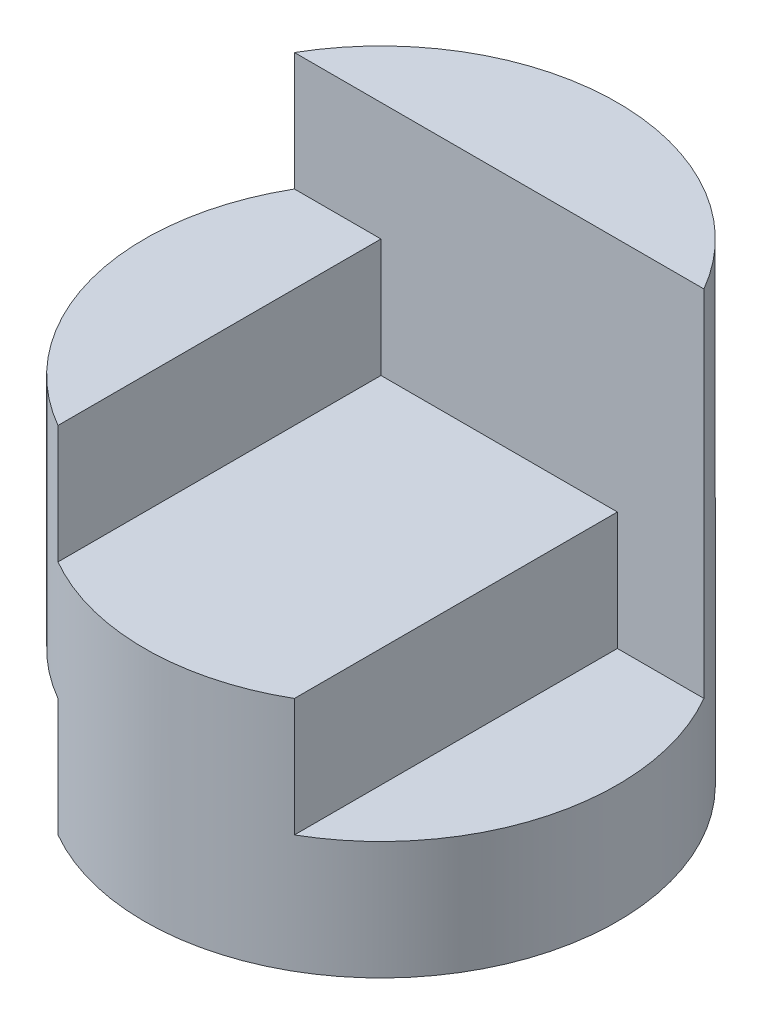
ISO-10303-21;
HEADER;
FILE_DESCRIPTION(('STEP AP214'),'2;1');
FILE_NAME('part.step','',(''),(''),'','','');
FILE_SCHEMA(('AUTOMOTIVE_DESIGN { 1 0 10303 214 1 1 1 1 }'));
ENDSEC;
DATA;
#1=APPLICATION_CONTEXT('core data for automotive mechanical design processes');
#2=APPLICATION_PROTOCOL_DEFINITION('international standard','automotive_design',2000,#1);
#3=PRODUCT_CONTEXT('',#1,'mechanical');
#4=PRODUCT('Part','Part','',(#3));
#5=PRODUCT_RELATED_PRODUCT_CATEGORY('part','',(#4));
#6=PRODUCT_DEFINITION_FORMATION('','',#4);
#7=PRODUCT_DEFINITION_CONTEXT('part definition',#1,'design');
#8=PRODUCT_DEFINITION('design','',#6,#7);
#9=PRODUCT_DEFINITION_SHAPE('','',#8);
#10=(LENGTH_UNIT() NAMED_UNIT(*) SI_UNIT(.MILLI.,.METRE.));
#11=(NAMED_UNIT(*) PLANE_ANGLE_UNIT() SI_UNIT($,.RADIAN.));
#12=(NAMED_UNIT(*) SI_UNIT($,.STERADIAN.) SOLID_ANGLE_UNIT());
#13=UNCERTAINTY_MEASURE_WITH_UNIT(LENGTH_MEASURE(1.E-05),#10,'distance_accuracy_value','');
#14=(GEOMETRIC_REPRESENTATION_CONTEXT(3) GLOBAL_UNCERTAINTY_ASSIGNED_CONTEXT((#13)) GLOBAL_UNIT_ASSIGNED_CONTEXT((#10,
#11,#12)) REPRESENTATION_CONTEXT('',''));
#15=CARTESIAN_POINT('',(0.,0.,0.));
#16=DIRECTION('',(0.,0.,1.));
#17=DIRECTION('',(1.,0.,0.));
#18=AXIS2_PLACEMENT_3D('',#15,#16,#17);
#19=CARTESIAN_POINT('',(0.,4.,0.));
#20=DIRECTION('',(0.,-1.,0.));
#21=DIRECTION('',(0.,0.,-1.));
#22=AXIS2_PLACEMENT_3D('',#19,#20,#21);
#23=CYLINDRICAL_SURFACE('',#22,2.);
#24=DIRECTION('',(0.,-1.,0.));
#25=VECTOR('',#24,1.);
#26=CARTESIAN_POINT('',(1.73205080756888,4.,-1.));
#27=LINE('',#26,#25);
#28=CARTESIAN_POINT('',(1.73205080756888,4.,-1.));
#29=VERTEX_POINT('',#28);
#30=CARTESIAN_POINT('',(1.73205080756888,1.,-1.));
#31=VERTEX_POINT('',#30);
#32=EDGE_CURVE('E47',#29,#31,#27,.T.);
#33=ORIENTED_EDGE('',*,*,#32,.T.);
#34=CARTESIAN_POINT('',(0.,1.,0.));
#35=DIRECTION('',(0.,1.,0.));
#36=DIRECTION('',(0.,0.,1.));
#37=AXIS2_PLACEMENT_3D('',#34,#35,#36);
#38=CIRCLE('',#37,2.);
#39=CARTESIAN_POINT('',(1.,1.,1.73205080756888));
#40=VERTEX_POINT('',#39);
#41=EDGE_CURVE('E40',#40,#31,#38,.T.);
#42=ORIENTED_EDGE('',*,*,#41,.F.);
#43=DIRECTION('',(0.,-1.,0.));
#44=VECTOR('',#43,1.);
#45=CARTESIAN_POINT('',(1.,4.,1.73205080756888));
#46=LINE('',#45,#44);
#47=CARTESIAN_POINT('',(1.,2.,1.73205080756888));
#48=VERTEX_POINT('',#47);
#49=EDGE_CURVE('E135',#48,#40,#46,.T.);
#50=ORIENTED_EDGE('',*,*,#49,.F.);
#51=CARTESIAN_POINT('',(0.,2.,0.));
#52=DIRECTION('',(0.,1.,0.));
#53=DIRECTION('',(-1.,0.,0.));
#54=AXIS2_PLACEMENT_3D('',#51,#52,#53);
#55=CIRCLE('',#54,2.);
#56=CARTESIAN_POINT('',(-1.,2.,1.73205080756888));
#57=VERTEX_POINT('',#56);
#58=EDGE_CURVE('E133',#57,#48,#55,.T.);
#59=ORIENTED_EDGE('',*,*,#58,.F.);
#60=DIRECTION('',(0.,-1.,0.));
#61=VECTOR('',#60,1.);
#62=CARTESIAN_POINT('',(-1.,4.,1.73205080756888));
#63=LINE('',#62,#61);
#64=CARTESIAN_POINT('',(-1.,3.,1.73205080756888));
#65=VERTEX_POINT('',#64);
#66=EDGE_CURVE('E131',#65,#57,#63,.T.);
#67=ORIENTED_EDGE('',*,*,#66,.F.);
#68=CARTESIAN_POINT('',(0.,3.,0.));
#69=DIRECTION('',(0.,1.,0.));
#70=DIRECTION('',(-1.,0.,0.));
#71=AXIS2_PLACEMENT_3D('',#68,#69,#70);
#72=CIRCLE('',#71,2.);
#73=CARTESIAN_POINT('',(-1.73205080756888,3.,-1.));
#74=VERTEX_POINT('',#73);
#75=EDGE_CURVE('E126',#74,#65,#72,.T.);
#76=ORIENTED_EDGE('',*,*,#75,.F.);
#77=DIRECTION('',(0.,-1.,0.));
#78=VECTOR('',#77,1.);
#79=CARTESIAN_POINT('',(-1.73205080756888,4.,-1.));
#80=LINE('',#79,#78);
#81=CARTESIAN_POINT('',(-1.73205080756888,4.,-1.));
#82=VERTEX_POINT('',#81);
#83=EDGE_CURVE('E155',#74,#82,#80,.F.);
#84=ORIENTED_EDGE('',*,*,#83,.T.);
#85=CARTESIAN_POINT('',(0.,4.,0.));
#86=DIRECTION('',(0.,1.,0.));
#87=DIRECTION('',(0.,0.,1.));
#88=AXIS2_PLACEMENT_3D('',#85,#86,#87);
#89=CIRCLE('',#88,2.);
#90=EDGE_CURVE('E112',#29,#82,#89,.T.);
#91=ORIENTED_EDGE('',*,*,#90,.F.);
#92=EDGE_LOOP('',(#33,#42,#50,#59,#67,#76,#84,#91));
#93=FACE_BOUND('',#92,.T.);
#94=DIRECTION('',(0.,-1.,0.));
#95=VECTOR('',#94,1.);
#96=CARTESIAN_POINT('',(-1.,4.,1.73205080756888));
#97=LINE('',#96,#95);
#98=CARTESIAN_POINT('',(-1.,0.,1.73205080756888));
#99=VERTEX_POINT('',#98);
#100=CARTESIAN_POINT('',(-1.,1.,1.73205080756888));
#101=VERTEX_POINT('',#100);
#102=EDGE_CURVE('E157',#99,#101,#97,.F.);
#103=ORIENTED_EDGE('',*,*,#102,.F.);
#104=CARTESIAN_POINT('',(0.,0.,0.));
#105=DIRECTION('',(0.,1.,0.));
#106=DIRECTION('',(0.,0.,1.));
#107=AXIS2_PLACEMENT_3D('',#104,#105,#106);
#108=CIRCLE('',#107,2.);
#109=CARTESIAN_POINT('',(-1.73205080756888,0.,-1.));
#110=VERTEX_POINT('',#109);
#111=EDGE_CURVE('E123',#99,#110,#108,.T.);
#112=ORIENTED_EDGE('',*,*,#111,.T.);
#113=DIRECTION('',(0.,-1.,0.));
#114=VECTOR('',#113,1.);
#115=CARTESIAN_POINT('',(-1.73205080756888,4.,-1.));
#116=LINE('',#115,#114);
#117=CARTESIAN_POINT('',(-1.73205080756888,1.,-1.));
#118=VERTEX_POINT('',#117);
#119=EDGE_CURVE('E55',#110,#118,#116,.F.);
#120=ORIENTED_EDGE('',*,*,#119,.T.);
#121=CARTESIAN_POINT('',(0.,1.,0.));
#122=DIRECTION('',(0.,-1.,0.));
#123=DIRECTION('',(0.,0.,-1.));
#124=AXIS2_PLACEMENT_3D('',#121,#122,#123);
#125=CIRCLE('',#124,2.);
#126=EDGE_CURVE('E11',#101,#118,#125,.T.);
#127=ORIENTED_EDGE('',*,*,#126,.F.);
#128=EDGE_LOOP('',(#103,#112,#120,#127));
#129=FACE_BOUND('',#128,.T.);
#130=ADVANCED_FACE('F33',(#93,#129),#23,.T.);
#131=CARTESIAN_POINT('',(0.,0.,0.));
#132=DIRECTION('',(0.,1.,0.));
#133=DIRECTION('',(0.,0.,1.));
#134=AXIS2_PLACEMENT_3D('',#131,#132,#133);
#135=PLANE('',#134);
#136=DIRECTION('',(0.,0.,1.));
#137=VECTOR('',#136,1.);
#138=CARTESIAN_POINT('',(-1.,0.,0.));
#139=LINE('',#138,#137);
#140=CARTESIAN_POINT('',(-1.,0.,-1.));
#141=VERTEX_POINT('',#140);
#142=EDGE_CURVE('E111',#141,#99,#139,.T.);
#143=ORIENTED_EDGE('',*,*,#142,.F.);
#144=DIRECTION('',(-1.,0.,0.));
#145=VECTOR('',#144,1.);
#146=CARTESIAN_POINT('',(0.,0.,-1.));
#147=LINE('',#146,#145);
#148=EDGE_CURVE('E102',#141,#110,#147,.T.);
#149=ORIENTED_EDGE('',*,*,#148,.T.);
#150=ORIENTED_EDGE('',*,*,#111,.F.);
#151=EDGE_LOOP('',(#143,#149,#150));
#152=FACE_BOUND('',#151,.T.);
#153=ADVANCED_FACE('F122',(#152),#135,.F.);
#154=CARTESIAN_POINT('',(0.,4.,0.));
#155=DIRECTION('',(0.,1.,0.));
#156=DIRECTION('',(0.,0.,1.));
#157=AXIS2_PLACEMENT_3D('',#154,#155,#156);
#158=PLANE('',#157);
#159=DIRECTION('',(-1.,0.,0.));
#160=VECTOR('',#159,1.);
#161=CARTESIAN_POINT('',(0.,4.,-1.));
#162=LINE('',#161,#160);
#163=EDGE_CURVE('E124',#29,#82,#162,.T.);
#164=ORIENTED_EDGE('',*,*,#163,.F.);
#165=ORIENTED_EDGE('',*,*,#90,.T.);
#166=EDGE_LOOP('',(#164,#165));
#167=FACE_BOUND('',#166,.T.);
#168=ADVANCED_FACE('F162',(#167),#158,.T.);
#169=CARTESIAN_POINT('',(-2.,1.,3.));
#170=DIRECTION('',(0.,-1.,0.));
#171=DIRECTION('',(0.,0.,-1.));
#172=AXIS2_PLACEMENT_3D('',#169,#170,#171);
#173=PLANE('',#172);
#174=DIRECTION('',(0.,0.,-1.));
#175=VECTOR('',#174,1.);
#176=CARTESIAN_POINT('',(-1.,1.,3.));
#177=LINE('',#176,#175);
#178=CARTESIAN_POINT('',(-1.,1.,-1.));
#179=VERTEX_POINT('',#178);
#180=EDGE_CURVE('E119',#101,#179,#177,.T.);
#181=ORIENTED_EDGE('',*,*,#180,.F.);
#182=ORIENTED_EDGE('',*,*,#126,.T.);
#183=DIRECTION('',(-1.,0.,0.));
#184=VECTOR('',#183,1.);
#185=CARTESIAN_POINT('',(-2.,1.,-1.));
#186=LINE('',#185,#184);
#187=EDGE_CURVE('E120',#179,#118,#186,.T.);
#188=ORIENTED_EDGE('',*,*,#187,.F.);
#189=EDGE_LOOP('',(#181,#182,#188));
#190=FACE_BOUND('',#189,.T.);
#191=ADVANCED_FACE('F186',(#190),#173,.T.);
#192=CARTESIAN_POINT('',(-1.,0.,3.));
#193=DIRECTION('',(-1.,0.,0.));
#194=DIRECTION('',(0.,0.,1.));
#195=AXIS2_PLACEMENT_3D('',#192,#193,#194);
#196=PLANE('',#195);
#197=ORIENTED_EDGE('',*,*,#102,.T.);
#198=ORIENTED_EDGE('',*,*,#180,.T.);
#199=DIRECTION('',(0.,1.,0.));
#200=VECTOR('',#199,1.);
#201=CARTESIAN_POINT('',(-1.,0.,-1.));
#202=LINE('',#201,#200);
#203=EDGE_CURVE('E105',#141,#179,#202,.T.);
#204=ORIENTED_EDGE('',*,*,#203,.F.);
#205=ORIENTED_EDGE('',*,*,#142,.T.);
#206=EDGE_LOOP('',(#197,#198,#204,#205));
#207=FACE_BOUND('',#206,.T.);
#208=ADVANCED_FACE('F116',(#207),#196,.T.);
#209=CARTESIAN_POINT('',(0.,0.,-1.));
#210=DIRECTION('',(0.,0.,-1.));
#211=DIRECTION('',(-1.,0.,0.));
#212=AXIS2_PLACEMENT_3D('',#209,#210,#211);
#213=PLANE('',#212);
#214=ORIENTED_EDGE('',*,*,#148,.F.);
#215=ORIENTED_EDGE('',*,*,#203,.T.);
#216=ORIENTED_EDGE('',*,*,#187,.T.);
#217=ORIENTED_EDGE('',*,*,#119,.F.);
#218=EDGE_LOOP('',(#214,#215,#216,#217));
#219=FACE_BOUND('',#218,.T.);
#220=ADVANCED_FACE('F104',(#219),#213,.F.);
#221=CARTESIAN_POINT('',(-1.,3.,3.));
#222=DIRECTION('',(0.,1.,0.));
#223=DIRECTION('',(-1.,0.,0.));
#224=AXIS2_PLACEMENT_3D('',#221,#222,#223);
#225=PLANE('',#224);
#226=ORIENTED_EDGE('',*,*,#75,.T.);
#227=DIRECTION('',(0.,0.,-1.));
#228=VECTOR('',#227,1.);
#229=CARTESIAN_POINT('',(-1.,3.,3.));
#230=LINE('',#229,#228);
#231=CARTESIAN_POINT('',(-1.,3.,-1.));
#232=VERTEX_POINT('',#231);
#233=EDGE_CURVE('E171',#65,#232,#230,.T.);
#234=ORIENTED_EDGE('',*,*,#233,.T.);
#235=DIRECTION('',(1.,0.,0.));
#236=VECTOR('',#235,1.);
#237=CARTESIAN_POINT('',(-1.,3.,-1.));
#238=LINE('',#237,#236);
#239=EDGE_CURVE('E172',#74,#232,#238,.T.);
#240=ORIENTED_EDGE('',*,*,#239,.F.);
#241=EDGE_LOOP('',(#226,#234,#240));
#242=FACE_BOUND('',#241,.T.);
#243=ADVANCED_FACE('F170',(#242),#225,.T.);
#244=CARTESIAN_POINT('',(-1.,2.,3.));
#245=DIRECTION('',(1.,0.,0.));
#246=DIRECTION('',(0.,0.,-1.));
#247=AXIS2_PLACEMENT_3D('',#244,#245,#246);
#248=PLANE('',#247);
#249=ORIENTED_EDGE('',*,*,#66,.T.);
#250=DIRECTION('',(0.,0.,-1.));
#251=VECTOR('',#250,1.);
#252=CARTESIAN_POINT('',(-1.,2.,3.));
#253=LINE('',#252,#251);
#254=CARTESIAN_POINT('',(-1.,2.,-1.));
#255=VERTEX_POINT('',#254);
#256=EDGE_CURVE('E179',#57,#255,#253,.T.);
#257=ORIENTED_EDGE('',*,*,#256,.T.);
#258=DIRECTION('',(0.,-1.,0.));
#259=VECTOR('',#258,1.);
#260=CARTESIAN_POINT('',(-1.,2.,-1.));
#261=LINE('',#260,#259);
#262=EDGE_CURVE('E178',#232,#255,#261,.T.);
#263=ORIENTED_EDGE('',*,*,#262,.F.);
#264=ORIENTED_EDGE('',*,*,#233,.F.);
#265=EDGE_LOOP('',(#249,#257,#263,#264));
#266=FACE_BOUND('',#265,.T.);
#267=ADVANCED_FACE('F175',(#266),#248,.T.);
#268=CARTESIAN_POINT('',(1.,2.,3.));
#269=DIRECTION('',(0.,1.,0.));
#270=DIRECTION('',(-1.,0.,0.));
#271=AXIS2_PLACEMENT_3D('',#268,#269,#270);
#272=PLANE('',#271);
#273=ORIENTED_EDGE('',*,*,#58,.T.);
#274=DIRECTION('',(0.,0.,-1.));
#275=VECTOR('',#274,1.);
#276=CARTESIAN_POINT('',(1.,2.,3.));
#277=LINE('',#276,#275);
#278=CARTESIAN_POINT('',(1.,2.,-1.));
#279=VERTEX_POINT('',#278);
#280=EDGE_CURVE('E182',#48,#279,#277,.T.);
#281=ORIENTED_EDGE('',*,*,#280,.T.);
#282=DIRECTION('',(1.,0.,0.));
#283=VECTOR('',#282,1.);
#284=CARTESIAN_POINT('',(1.,2.,-1.));
#285=LINE('',#284,#283);
#286=EDGE_CURVE('E192',#255,#279,#285,.T.);
#287=ORIENTED_EDGE('',*,*,#286,.F.);
#288=ORIENTED_EDGE('',*,*,#256,.F.);
#289=EDGE_LOOP('',(#273,#281,#287,#288));
#290=FACE_BOUND('',#289,.T.);
#291=ADVANCED_FACE('F198',(#290),#272,.T.);
#292=CARTESIAN_POINT('',(1.,1.,3.));
#293=DIRECTION('',(1.,0.,0.));
#294=DIRECTION('',(0.,1.,0.));
#295=AXIS2_PLACEMENT_3D('',#292,#293,#294);
#296=PLANE('',#295);
#297=ORIENTED_EDGE('',*,*,#49,.T.);
#298=DIRECTION('',(0.,0.,-1.));
#299=VECTOR('',#298,1.);
#300=CARTESIAN_POINT('',(1.,1.,3.));
#301=LINE('',#300,#299);
#302=CARTESIAN_POINT('',(1.,1.,-1.));
#303=VERTEX_POINT('',#302);
#304=EDGE_CURVE('E143',#40,#303,#301,.T.);
#305=ORIENTED_EDGE('',*,*,#304,.T.);
#306=DIRECTION('',(0.,-1.,0.));
#307=VECTOR('',#306,1.);
#308=CARTESIAN_POINT('',(1.,1.,-1.));
#309=LINE('',#308,#307);
#310=EDGE_CURVE('E149',#279,#303,#309,.T.);
#311=ORIENTED_EDGE('',*,*,#310,.F.);
#312=ORIENTED_EDGE('',*,*,#280,.F.);
#313=EDGE_LOOP('',(#297,#305,#311,#312));
#314=FACE_BOUND('',#313,.T.);
#315=ADVANCED_FACE('F200',(#314),#296,.T.);
#316=CARTESIAN_POINT('',(2.,1.,3.));
#317=DIRECTION('',(0.,1.,0.));
#318=DIRECTION('',(0.,0.,1.));
#319=AXIS2_PLACEMENT_3D('',#316,#317,#318);
#320=PLANE('',#319);
#321=ORIENTED_EDGE('',*,*,#41,.T.);
#322=DIRECTION('',(1.,0.,0.));
#323=VECTOR('',#322,1.);
#324=CARTESIAN_POINT('',(2.,1.,-1.));
#325=LINE('',#324,#323);
#326=EDGE_CURVE('E141',#303,#31,#325,.T.);
#327=ORIENTED_EDGE('',*,*,#326,.F.);
#328=ORIENTED_EDGE('',*,*,#304,.F.);
#329=EDGE_LOOP('',(#321,#327,#328));
#330=FACE_BOUND('',#329,.T.);
#331=ADVANCED_FACE('F140',(#330),#320,.T.);
#332=CARTESIAN_POINT('',(0.,0.,-1.));
#333=DIRECTION('',(0.,0.,-1.));
#334=DIRECTION('',(-1.,0.,0.));
#335=AXIS2_PLACEMENT_3D('',#332,#333,#334);
#336=PLANE('',#335);
#337=ORIENTED_EDGE('',*,*,#163,.T.);
#338=ORIENTED_EDGE('',*,*,#83,.F.);
#339=ORIENTED_EDGE('',*,*,#239,.T.);
#340=ORIENTED_EDGE('',*,*,#262,.T.);
#341=ORIENTED_EDGE('',*,*,#286,.T.);
#342=ORIENTED_EDGE('',*,*,#310,.T.);
#343=ORIENTED_EDGE('',*,*,#326,.T.);
#344=ORIENTED_EDGE('',*,*,#32,.F.);
#345=EDGE_LOOP('',(#337,#338,#339,#340,#341,#342,#343,#344));
#346=FACE_BOUND('',#345,.T.);
#347=ADVANCED_FACE('F146',(#346),#336,.F.);
#348=CLOSED_SHELL('',(#130,#153,#168,#191,#208,#220,#243,#267,#291,#315,#331,#347));
#349=MANIFOLD_SOLID_BREP('B2',#348);
#350=ADVANCED_BREP_SHAPE_REPRESENTATION('',(#18,#349),#14);
#351=SHAPE_DEFINITION_REPRESENTATION(#9,#350);
ENDSEC;
END-ISO-10303-21;
